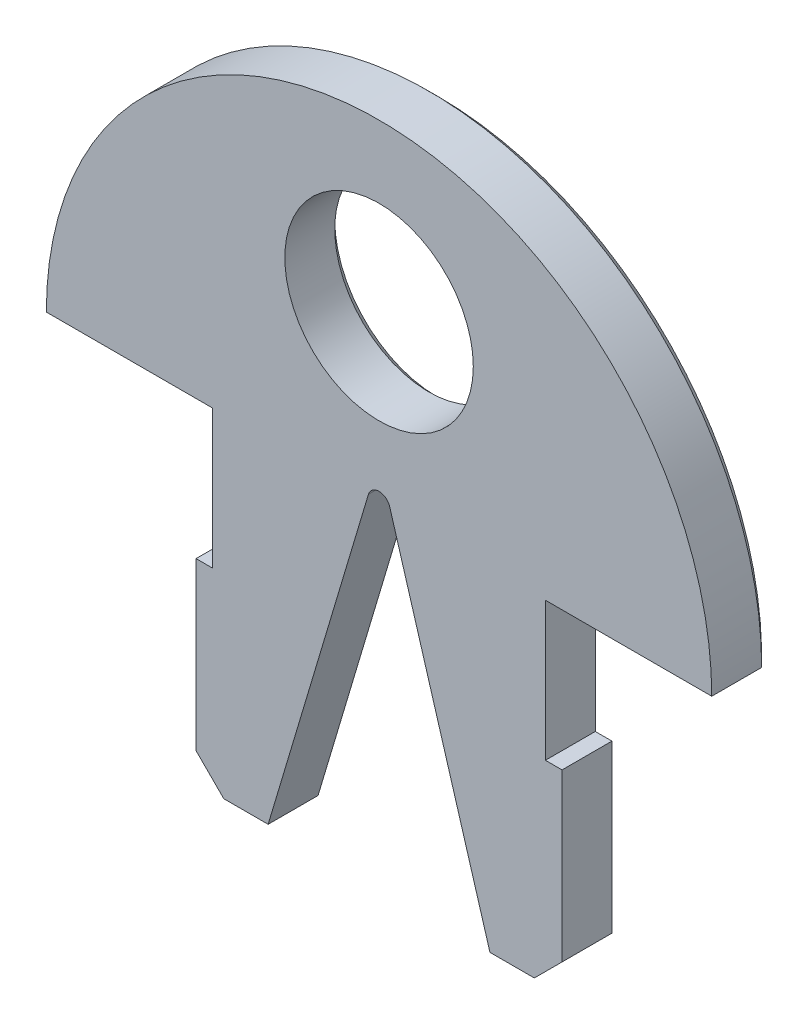
ISO-10303-21;
HEADER;
FILE_DESCRIPTION(('STEP AP214'),'2;1');
FILE_NAME('part.step','',(''),(''),'','','');
FILE_SCHEMA(('AUTOMOTIVE_DESIGN { 1 0 10303 214 1 1 1 1 }'));
ENDSEC;
DATA;
#1=APPLICATION_CONTEXT('core data for automotive mechanical design processes');
#2=APPLICATION_PROTOCOL_DEFINITION('international standard','automotive_design',2000,#1);
#3=PRODUCT_CONTEXT('',#1,'mechanical');
#4=PRODUCT('Part','Part','',(#3));
#5=PRODUCT_RELATED_PRODUCT_CATEGORY('part','',(#4));
#6=PRODUCT_DEFINITION_FORMATION('','',#4);
#7=PRODUCT_DEFINITION_CONTEXT('part definition',#1,'design');
#8=PRODUCT_DEFINITION('design','',#6,#7);
#9=PRODUCT_DEFINITION_SHAPE('','',#8);
#10=(LENGTH_UNIT() NAMED_UNIT(*) SI_UNIT(.MILLI.,.METRE.));
#11=(NAMED_UNIT(*) PLANE_ANGLE_UNIT() SI_UNIT($,.RADIAN.));
#12=(NAMED_UNIT(*) SI_UNIT($,.STERADIAN.) SOLID_ANGLE_UNIT());
#13=UNCERTAINTY_MEASURE_WITH_UNIT(LENGTH_MEASURE(1.E-05),#10,'distance_accuracy_value','');
#14=(GEOMETRIC_REPRESENTATION_CONTEXT(3) GLOBAL_UNCERTAINTY_ASSIGNED_CONTEXT((#13)) GLOBAL_UNIT_ASSIGNED_CONTEXT((#10,
#11,#12)) REPRESENTATION_CONTEXT('',''));
#15=CARTESIAN_POINT('',(0.,0.,0.));
#16=DIRECTION('',(0.,0.,1.));
#17=DIRECTION('',(1.,0.,0.));
#18=AXIS2_PLACEMENT_3D('',#15,#16,#17);
#19=CARTESIAN_POINT('',(0.,5.99999999999999,2.1));
#20=DIRECTION('',(0.,0.,1.));
#21=DIRECTION('',(1.,0.,0.));
#22=AXIS2_PLACEMENT_3D('',#19,#20,#21);
#23=PLANE('',#22);
#24=DIRECTION('',(1.,0.,0.));
#25=VECTOR('',#24,1.);
#26=CARTESIAN_POINT('',(4.,-6.00000000000001,2.1));
#27=LINE('',#26,#25);
#28=CARTESIAN_POINT('',(4.,-6.00000000000001,2.1));
#29=VERTEX_POINT('',#28);
#30=CARTESIAN_POINT('',(5.6,-6.00000000000001,2.1));
#31=VERTEX_POINT('',#30);
#32=EDGE_CURVE('E206',#29,#31,#27,.T.);
#33=ORIENTED_EDGE('',*,*,#32,.T.);
#34=DIRECTION('',(-0.707106781186549,-0.707106781186546,0.));
#35=VECTOR('',#34,1.);
#36=CARTESIAN_POINT('',(8.79999999999999,-2.80000000000003,2.1));
#37=LINE('',#36,#35);
#38=CARTESIAN_POINT('',(6.6,-5.00000000000001,2.1));
#39=VERTEX_POINT('',#38);
#40=EDGE_CURVE('E204',#31,#39,#37,.F.);
#41=ORIENTED_EDGE('',*,*,#40,.T.);
#42=DIRECTION('',(0.,1.,0.));
#43=VECTOR('',#42,1.);
#44=CARTESIAN_POINT('',(6.6,-6.00000000000001,2.1));
#45=LINE('',#44,#43);
#46=CARTESIAN_POINT('',(6.59999999999999,0.999999999999994,2.1));
#47=VERTEX_POINT('',#46);
#48=EDGE_CURVE('E196',#39,#47,#45,.T.);
#49=ORIENTED_EDGE('',*,*,#48,.T.);
#50=DIRECTION('',(-1.,0.,0.));
#51=VECTOR('',#50,1.);
#52=CARTESIAN_POINT('',(5.99999999999999,0.999999999999994,2.1));
#53=LINE('',#52,#51);
#54=CARTESIAN_POINT('',(5.99999999999999,0.999999999999994,2.1));
#55=VERTEX_POINT('',#54);
#56=EDGE_CURVE('E201',#47,#55,#53,.T.);
#57=ORIENTED_EDGE('',*,*,#56,.T.);
#58=DIRECTION('',(0.,1.,0.));
#59=VECTOR('',#58,1.);
#60=CARTESIAN_POINT('',(6.,5.99999999999999,2.1));
#61=LINE('',#60,#59);
#62=CARTESIAN_POINT('',(6.,5.99999999999999,2.1));
#63=VERTEX_POINT('',#62);
#64=EDGE_CURVE('E221',#55,#63,#61,.T.);
#65=ORIENTED_EDGE('',*,*,#64,.T.);
#66=DIRECTION('',(1.,0.,0.));
#67=VECTOR('',#66,1.);
#68=CARTESIAN_POINT('',(6.,5.99999999999999,2.1));
#69=LINE('',#68,#67);
#70=CARTESIAN_POINT('',(12.,5.99999999999999,2.1));
#71=VERTEX_POINT('',#70);
#72=EDGE_CURVE('E223',#63,#71,#69,.T.);
#73=ORIENTED_EDGE('',*,*,#72,.T.);
#74=CARTESIAN_POINT('',(0.,5.99999999999999,2.1));
#75=DIRECTION('',(0.,0.,1.));
#76=DIRECTION('',(1.,0.,0.));
#77=AXIS2_PLACEMENT_3D('',#74,#75,#76);
#78=CIRCLE('',#77,12.);
#79=CARTESIAN_POINT('',(-12.,5.99999999999999,2.1));
#80=VERTEX_POINT('',#79);
#81=EDGE_CURVE('E228',#71,#80,#78,.T.);
#82=ORIENTED_EDGE('',*,*,#81,.T.);
#83=DIRECTION('',(1.,0.,0.));
#84=VECTOR('',#83,1.);
#85=CARTESIAN_POINT('',(-12.,5.99999999999999,2.1));
#86=LINE('',#85,#84);
#87=CARTESIAN_POINT('',(-6.,5.99999999999999,2.1));
#88=VERTEX_POINT('',#87);
#89=EDGE_CURVE('E230',#80,#88,#86,.T.);
#90=ORIENTED_EDGE('',*,*,#89,.T.);
#91=DIRECTION('',(0.,-1.,0.));
#92=VECTOR('',#91,1.);
#93=CARTESIAN_POINT('',(-6.,5.99999999999999,2.1));
#94=LINE('',#93,#92);
#95=CARTESIAN_POINT('',(-5.99999999999999,0.999999999999994,2.1));
#96=VERTEX_POINT('',#95);
#97=EDGE_CURVE('E232',#88,#96,#94,.T.);
#98=ORIENTED_EDGE('',*,*,#97,.T.);
#99=DIRECTION('',(-1.,0.,0.));
#100=VECTOR('',#99,1.);
#101=CARTESIAN_POINT('',(-5.99999999999999,0.999999999999994,2.1));
#102=LINE('',#101,#100);
#103=CARTESIAN_POINT('',(-6.59999999999999,0.999999999999994,2.1));
#104=VERTEX_POINT('',#103);
#105=EDGE_CURVE('E234',#96,#104,#102,.T.);
#106=ORIENTED_EDGE('',*,*,#105,.T.);
#107=DIRECTION('',(0.,-1.,0.));
#108=VECTOR('',#107,1.);
#109=CARTESIAN_POINT('',(-6.6,-6.00000000000001,2.1));
#110=LINE('',#109,#108);
#111=CARTESIAN_POINT('',(-6.6,-5.,2.1));
#112=VERTEX_POINT('',#111);
#113=EDGE_CURVE('E236',#104,#112,#110,.T.);
#114=ORIENTED_EDGE('',*,*,#113,.T.);
#115=DIRECTION('',(-0.707106781186545,0.70710678118655,0.));
#116=VECTOR('',#115,1.);
#117=CARTESIAN_POINT('',(-8.80000000000002,-2.79999999999997,2.1));
#118=LINE('',#117,#116);
#119=CARTESIAN_POINT('',(-5.6,-6.00000000000001,2.1));
#120=VERTEX_POINT('',#119);
#121=EDGE_CURVE('E280',#112,#120,#118,.F.);
#122=ORIENTED_EDGE('',*,*,#121,.T.);
#123=DIRECTION('',(1.,0.,0.));
#124=VECTOR('',#123,1.);
#125=CARTESIAN_POINT('',(-6.,-6.00000000000001,2.1));
#126=LINE('',#125,#124);
#127=CARTESIAN_POINT('',(-4.,-6.00000000000001,2.1));
#128=VERTEX_POINT('',#127);
#129=EDGE_CURVE('E239',#120,#128,#126,.T.);
#130=ORIENTED_EDGE('',*,*,#129,.T.);
#131=DIRECTION('',(0.286069612585582,0.958208837756747,0.));
#132=VECTOR('',#131,1.);
#133=CARTESIAN_POINT('',(-4.,-6.00000000000001,2.1));
#134=LINE('',#133,#132);
#135=CARTESIAN_POINT('',(-0.383283535102698,6.11442784503422,2.1));
#136=VERTEX_POINT('',#135);
#137=EDGE_CURVE('E241',#128,#136,#134,.T.);
#138=ORIENTED_EDGE('',*,*,#137,.T.);
#139=CARTESIAN_POINT('',(0.,5.99999999999999,2.1));
#140=DIRECTION('',(0.,0.,-1.));
#141=DIRECTION('',(1.,0.,0.));
#142=AXIS2_PLACEMENT_3D('',#139,#140,#141);
#143=CIRCLE('',#142,0.4);
#144=CARTESIAN_POINT('',(0.383283535102698,6.11442784503422,2.1));
#145=VERTEX_POINT('',#144);
#146=EDGE_CURVE('E243',#136,#145,#143,.T.);
#147=ORIENTED_EDGE('',*,*,#146,.T.);
#148=DIRECTION('',(0.286069612585582,-0.958208837756747,0.));
#149=VECTOR('',#148,1.);
#150=CARTESIAN_POINT('',(0.383283535102699,6.11442784503422,2.1));
#151=LINE('',#150,#149);
#152=EDGE_CURVE('E245',#145,#29,#151,.T.);
#153=ORIENTED_EDGE('',*,*,#152,.T.);
#154=EDGE_LOOP('',(#33,#41,#49,#57,#65,#73,#82,#90,#98,#106,#114,#122,#130,#138,#147,#153));
#155=FACE_BOUND('',#154,.T.);
#156=CARTESIAN_POINT('',(0.,12.,2.1));
#157=DIRECTION('',(0.,0.,1.));
#158=DIRECTION('',(1.,0.,0.));
#159=AXIS2_PLACEMENT_3D('',#156,#157,#158);
#160=CIRCLE('',#159,3.39925487353985);
#161=CARTESIAN_POINT('',(3.39925487353984,12.,2.1));
#162=VERTEX_POINT('',#161);
#163=EDGE_CURVE('E429',#162,#162,#160,.T.);
#164=ORIENTED_EDGE('',*,*,#163,.F.);
#165=EDGE_LOOP('',(#164));
#166=FACE_BOUND('',#165,.T.);
#167=ADVANCED_FACE('F34',(#155,#166),#23,.T.);
#168=CARTESIAN_POINT('',(0.,5.99999999999999,0.));
#169=DIRECTION('',(0.,0.,1.));
#170=DIRECTION('',(1.,0.,0.));
#171=AXIS2_PLACEMENT_3D('',#168,#169,#170);
#172=PLANE('',#171);
#173=CARTESIAN_POINT('',(0.,12.,0.));
#174=DIRECTION('',(0.,0.,1.));
#175=DIRECTION('',(1.,0.,0.));
#176=AXIS2_PLACEMENT_3D('',#173,#174,#175);
#177=CIRCLE('',#176,3.69925487353985);
#178=CARTESIAN_POINT('',(3.69925487353984,12.,0.));
#179=VERTEX_POINT('',#178);
#180=EDGE_CURVE('E321',#179,#179,#177,.T.);
#181=ORIENTED_EDGE('',*,*,#180,.T.);
#182=EDGE_LOOP('',(#181));
#183=FACE_BOUND('',#182,.T.);
#184=DIRECTION('',(0.,-1.,0.));
#185=VECTOR('',#184,1.);
#186=CARTESIAN_POINT('',(5.7,5.99999999999998,0.));
#187=LINE('',#186,#185);
#188=CARTESIAN_POINT('',(5.7,6.3,0.));
#189=VERTEX_POINT('',#188);
#190=CARTESIAN_POINT('',(5.69999999999999,0.699999999999993,0.));
#191=VERTEX_POINT('',#190);
#192=EDGE_CURVE('E316',#189,#191,#187,.T.);
#193=ORIENTED_EDGE('',*,*,#192,.T.);
#194=DIRECTION('',(1.,0.,0.));
#195=VECTOR('',#194,1.);
#196=CARTESIAN_POINT('',(0.,0.699999999999997,0.));
#197=LINE('',#196,#195);
#198=CARTESIAN_POINT('',(6.29999999999999,0.699999999999992,0.));
#199=VERTEX_POINT('',#198);
#200=EDGE_CURVE('E318',#191,#199,#197,.T.);
#201=ORIENTED_EDGE('',*,*,#200,.T.);
#202=DIRECTION('',(0.,-1.,0.));
#203=VECTOR('',#202,1.);
#204=CARTESIAN_POINT('',(6.29999999999998,6.,0.));
#205=LINE('',#204,#203);
#206=CARTESIAN_POINT('',(6.3,-4.87573593128808,0.));
#207=VERTEX_POINT('',#206);
#208=EDGE_CURVE('E288',#199,#207,#205,.T.);
#209=ORIENTED_EDGE('',*,*,#208,.T.);
#210=DIRECTION('',(-0.707106781186549,-0.707106781186546,0.));
#211=VECTOR('',#210,1.);
#212=CARTESIAN_POINT('',(5.38786796564403,-5.78786796564404,0.));
#213=LINE('',#212,#211);
#214=CARTESIAN_POINT('',(5.47573593128807,-5.7,0.));
#215=VERTEX_POINT('',#214);
#216=EDGE_CURVE('E290',#207,#215,#213,.T.);
#217=ORIENTED_EDGE('',*,*,#216,.T.);
#218=DIRECTION('',(-1.,0.,0.));
#219=VECTOR('',#218,1.);
#220=CARTESIAN_POINT('',(0.,-5.7,0.));
#221=LINE('',#220,#219);
#222=CARTESIAN_POINT('',(4.22352028888164,-5.7,0.));
#223=VERTEX_POINT('',#222);
#224=EDGE_CURVE('E292',#215,#223,#221,.T.);
#225=ORIENTED_EDGE('',*,*,#224,.T.);
#226=DIRECTION('',(-0.286069612585582,0.958208837756746,0.));
#227=VECTOR('',#226,1.);
#228=CARTESIAN_POINT('',(0.670746186429724,6.2002487288099,0.));
#229=LINE('',#228,#227);
#230=CARTESIAN_POINT('',(0.670746186429724,6.2002487288099,0.));
#231=VERTEX_POINT('',#230);
#232=EDGE_CURVE('E294',#223,#231,#229,.T.);
#233=ORIENTED_EDGE('',*,*,#232,.T.);
#234=CARTESIAN_POINT('',(0.,5.99999999999999,0.));
#235=DIRECTION('',(0.,0.,1.));
#236=DIRECTION('',(1.,0.,0.));
#237=AXIS2_PLACEMENT_3D('',#234,#235,#236);
#238=CIRCLE('',#237,0.700000000000001);
#239=CARTESIAN_POINT('',(-0.670746186429724,6.2002487288099,0.));
#240=VERTEX_POINT('',#239);
#241=EDGE_CURVE('E296',#231,#240,#238,.T.);
#242=ORIENTED_EDGE('',*,*,#241,.T.);
#243=DIRECTION('',(-0.286069612585582,-0.958208837756747,0.));
#244=VECTOR('',#243,1.);
#245=CARTESIAN_POINT('',(-0.670746186429724,6.2002487288099,0.));
#246=LINE('',#245,#244);
#247=CARTESIAN_POINT('',(-4.22352028888164,-5.70000000000001,0.));
#248=VERTEX_POINT('',#247);
#249=EDGE_CURVE('E298',#240,#248,#246,.T.);
#250=ORIENTED_EDGE('',*,*,#249,.T.);
#251=DIRECTION('',(-1.,0.,0.));
#252=VECTOR('',#251,1.);
#253=CARTESIAN_POINT('',(0.,-5.70000000000002,0.));
#254=LINE('',#253,#252);
#255=CARTESIAN_POINT('',(-5.47573593128807,-5.70000000000001,0.));
#256=VERTEX_POINT('',#255);
#257=EDGE_CURVE('E300',#248,#256,#254,.T.);
#258=ORIENTED_EDGE('',*,*,#257,.T.);
#259=DIRECTION('',(-0.707106781186545,0.70710678118655,0.));
#260=VECTOR('',#259,1.);
#261=CARTESIAN_POINT('',(-6.38786796564403,-4.78786796564404,0.));
#262=LINE('',#261,#260);
#263=CARTESIAN_POINT('',(-6.29999999999999,-4.87573593128807,0.));
#264=VERTEX_POINT('',#263);
#265=EDGE_CURVE('E302',#256,#264,#262,.T.);
#266=ORIENTED_EDGE('',*,*,#265,.T.);
#267=DIRECTION('',(0.,1.,0.));
#268=VECTOR('',#267,1.);
#269=CARTESIAN_POINT('',(-6.29999999999998,6.,0.));
#270=LINE('',#269,#268);
#271=CARTESIAN_POINT('',(-6.29999999999999,0.699999999999992,0.));
#272=VERTEX_POINT('',#271);
#273=EDGE_CURVE('E304',#264,#272,#270,.T.);
#274=ORIENTED_EDGE('',*,*,#273,.T.);
#275=DIRECTION('',(1.,0.,0.));
#276=VECTOR('',#275,1.);
#277=CARTESIAN_POINT('',(0.,0.699999999999997,0.));
#278=LINE('',#277,#276);
#279=CARTESIAN_POINT('',(-5.69999999999999,0.699999999999993,0.));
#280=VERTEX_POINT('',#279);
#281=EDGE_CURVE('E306',#272,#280,#278,.T.);
#282=ORIENTED_EDGE('',*,*,#281,.T.);
#283=DIRECTION('',(0.,1.,0.));
#284=VECTOR('',#283,1.);
#285=CARTESIAN_POINT('',(-5.7,5.99999999999998,0.));
#286=LINE('',#285,#284);
#287=CARTESIAN_POINT('',(-5.7,6.3,0.));
#288=VERTEX_POINT('',#287);
#289=EDGE_CURVE('E308',#280,#288,#286,.T.);
#290=ORIENTED_EDGE('',*,*,#289,.T.);
#291=DIRECTION('',(-1.,0.,0.));
#292=VECTOR('',#291,1.);
#293=CARTESIAN_POINT('',(0.,6.3,0.));
#294=LINE('',#293,#292);
#295=CARTESIAN_POINT('',(-11.6961532137708,6.29999999999999,0.));
#296=VERTEX_POINT('',#295);
#297=EDGE_CURVE('E310',#288,#296,#294,.T.);
#298=ORIENTED_EDGE('',*,*,#297,.T.);
#299=CARTESIAN_POINT('',(0.,5.99999999999999,0.));
#300=DIRECTION('',(0.,0.,1.));
#301=DIRECTION('',(1.,0.,0.));
#302=AXIS2_PLACEMENT_3D('',#299,#300,#301);
#303=CIRCLE('',#302,11.7);
#304=CARTESIAN_POINT('',(11.6961532137708,6.29999999999999,0.));
#305=VERTEX_POINT('',#304);
#306=EDGE_CURVE('E312',#296,#305,#303,.F.);
#307=ORIENTED_EDGE('',*,*,#306,.T.);
#308=DIRECTION('',(-1.,0.,0.));
#309=VECTOR('',#308,1.);
#310=CARTESIAN_POINT('',(0.,6.3,0.));
#311=LINE('',#310,#309);
#312=EDGE_CURVE('E314',#305,#189,#311,.T.);
#313=ORIENTED_EDGE('',*,*,#312,.T.);
#314=EDGE_LOOP('',(#193,#201,#209,#217,#225,#233,#242,#250,#258,#266,#274,#282,#290,#298,#307,#313));
#315=FACE_BOUND('',#314,.T.);
#316=ADVANCED_FACE('F524',(#183,#315),#172,.F.);
#317=CARTESIAN_POINT('',(6.,-6.00000000000001,2.1));
#318=DIRECTION('',(0.,1.,0.));
#319=DIRECTION('',(0.,0.,1.));
#320=AXIS2_PLACEMENT_3D('',#317,#318,#319);
#321=PLANE('',#320);
#322=DIRECTION('',(0.,0.,-1.));
#323=VECTOR('',#322,1.);
#324=CARTESIAN_POINT('',(4.,-6.00000000000001,2.1));
#325=LINE('',#324,#323);
#326=CARTESIAN_POINT('',(4.,-6.00000000000001,0.300000000000002));
#327=VERTEX_POINT('',#326);
#328=EDGE_CURVE('E247',#29,#327,#325,.T.);
#329=ORIENTED_EDGE('',*,*,#328,.T.);
#330=DIRECTION('',(1.,0.,0.));
#331=VECTOR('',#330,1.);
#332=CARTESIAN_POINT('',(6.,-6.00000000000001,0.300000000000002));
#333=LINE('',#332,#331);
#334=CARTESIAN_POINT('',(5.6,-6.00000000000001,0.300000000000002));
#335=VERTEX_POINT('',#334);
#336=EDGE_CURVE('E58',#327,#335,#333,.T.);
#337=ORIENTED_EDGE('',*,*,#336,.T.);
#338=DIRECTION('',(0.,0.,1.));
#339=VECTOR('',#338,1.);
#340=CARTESIAN_POINT('',(5.6,-6.00000000000001,2.1));
#341=LINE('',#340,#339);
#342=EDGE_CURVE('E278',#335,#31,#341,.T.);
#343=ORIENTED_EDGE('',*,*,#342,.T.);
#344=ORIENTED_EDGE('',*,*,#32,.F.);
#345=EDGE_LOOP('',(#329,#337,#343,#344));
#346=FACE_BOUND('',#345,.T.);
#347=ADVANCED_FACE('F518',(#346),#321,.F.);
#348=CARTESIAN_POINT('',(6.6,-6.00000000000001,2.1));
#349=DIRECTION('',(-1.,0.,0.));
#350=DIRECTION('',(0.,-1.,0.));
#351=AXIS2_PLACEMENT_3D('',#348,#349,#350);
#352=PLANE('',#351);
#353=DIRECTION('',(0.,0.,-1.));
#354=VECTOR('',#353,1.);
#355=CARTESIAN_POINT('',(6.6,-5.,2.1));
#356=LINE('',#355,#354);
#357=CARTESIAN_POINT('',(6.6,-5.,0.300000000000002));
#358=VERTEX_POINT('',#357);
#359=EDGE_CURVE('E215',#39,#358,#356,.T.);
#360=ORIENTED_EDGE('',*,*,#359,.T.);
#361=DIRECTION('',(0.,1.,0.));
#362=VECTOR('',#361,1.);
#363=CARTESIAN_POINT('',(6.6,-6.00000000000001,0.300000000000002));
#364=LINE('',#363,#362);
#365=CARTESIAN_POINT('',(6.59999999999999,0.999999999999994,0.300000000000002));
#366=VERTEX_POINT('',#365);
#367=EDGE_CURVE('E11',#358,#366,#364,.T.);
#368=ORIENTED_EDGE('',*,*,#367,.T.);
#369=DIRECTION('',(0.,0.,-1.));
#370=VECTOR('',#369,1.);
#371=CARTESIAN_POINT('',(6.59999999999999,0.999999999999994,2.1));
#372=LINE('',#371,#370);
#373=EDGE_CURVE('E209',#47,#366,#372,.T.);
#374=ORIENTED_EDGE('',*,*,#373,.F.);
#375=ORIENTED_EDGE('',*,*,#48,.F.);
#376=EDGE_LOOP('',(#360,#368,#374,#375));
#377=FACE_BOUND('',#376,.T.);
#378=ADVANCED_FACE('F210',(#377),#352,.F.);
#379=CARTESIAN_POINT('',(5.99999999999999,0.999999999999994,2.1));
#380=DIRECTION('',(0.,-1.,0.));
#381=DIRECTION('',(1.,0.,0.));
#382=AXIS2_PLACEMENT_3D('',#379,#380,#381);
#383=PLANE('',#382);
#384=ORIENTED_EDGE('',*,*,#373,.T.);
#385=DIRECTION('',(-1.,0.,0.));
#386=VECTOR('',#385,1.);
#387=CARTESIAN_POINT('',(5.99999999999999,0.999999999999994,0.300000000000002));
#388=LINE('',#387,#386);
#389=CARTESIAN_POINT('',(5.99999999999999,0.999999999999994,0.300000000000002));
#390=VERTEX_POINT('',#389);
#391=EDGE_CURVE('E327',#366,#390,#388,.T.);
#392=ORIENTED_EDGE('',*,*,#391,.T.);
#393=DIRECTION('',(0.,0.,-1.));
#394=VECTOR('',#393,1.);
#395=CARTESIAN_POINT('',(5.99999999999999,0.999999999999994,2.1));
#396=LINE('',#395,#394);
#397=EDGE_CURVE('E216',#55,#390,#396,.T.);
#398=ORIENTED_EDGE('',*,*,#397,.F.);
#399=ORIENTED_EDGE('',*,*,#56,.F.);
#400=EDGE_LOOP('',(#384,#392,#398,#399));
#401=FACE_BOUND('',#400,.T.);
#402=ADVANCED_FACE('F218',(#401),#383,.F.);
#403=CARTESIAN_POINT('',(6.,5.99999999999999,2.1));
#404=DIRECTION('',(-1.,0.,0.));
#405=DIRECTION('',(0.,-1.,0.));
#406=AXIS2_PLACEMENT_3D('',#403,#404,#405);
#407=PLANE('',#406);
#408=ORIENTED_EDGE('',*,*,#397,.T.);
#409=DIRECTION('',(0.,1.,0.));
#410=VECTOR('',#409,1.);
#411=CARTESIAN_POINT('',(6.,5.99999999999999,0.300000000000002));
#412=LINE('',#411,#410);
#413=CARTESIAN_POINT('',(6.,5.99999999999999,0.300000000000002));
#414=VERTEX_POINT('',#413);
#415=EDGE_CURVE('E329',#390,#414,#412,.T.);
#416=ORIENTED_EDGE('',*,*,#415,.T.);
#417=DIRECTION('',(0.,0.,-1.));
#418=VECTOR('',#417,1.);
#419=CARTESIAN_POINT('',(6.,5.99999999999999,2.1));
#420=LINE('',#419,#418);
#421=EDGE_CURVE('E273',#63,#414,#420,.T.);
#422=ORIENTED_EDGE('',*,*,#421,.F.);
#423=ORIENTED_EDGE('',*,*,#64,.F.);
#424=EDGE_LOOP('',(#408,#416,#422,#423));
#425=FACE_BOUND('',#424,.T.);
#426=ADVANCED_FACE('F455',(#425),#407,.F.);
#427=CARTESIAN_POINT('',(6.,5.99999999999999,2.1));
#428=DIRECTION('',(0.,1.,0.));
#429=DIRECTION('',(-1.,0.,0.));
#430=AXIS2_PLACEMENT_3D('',#427,#428,#429);
#431=PLANE('',#430);
#432=ORIENTED_EDGE('',*,*,#421,.T.);
#433=DIRECTION('',(1.,0.,0.));
#434=VECTOR('',#433,1.);
#435=CARTESIAN_POINT('',(6.,5.99999999999999,0.300000000000002));
#436=LINE('',#435,#434);
#437=CARTESIAN_POINT('',(12.,5.99999999999999,0.300000000000002));
#438=VERTEX_POINT('',#437);
#439=EDGE_CURVE('E331',#414,#438,#436,.T.);
#440=ORIENTED_EDGE('',*,*,#439,.T.);
#441=DIRECTION('',(0.,0.,-1.));
#442=VECTOR('',#441,1.);
#443=CARTESIAN_POINT('',(12.,5.99999999999999,2.1));
#444=LINE('',#443,#442);
#445=EDGE_CURVE('E270',#71,#438,#444,.T.);
#446=ORIENTED_EDGE('',*,*,#445,.F.);
#447=ORIENTED_EDGE('',*,*,#72,.F.);
#448=EDGE_LOOP('',(#432,#440,#446,#447));
#449=FACE_BOUND('',#448,.T.);
#450=ADVANCED_FACE('F462',(#449),#431,.F.);
#451=CARTESIAN_POINT('',(0.,5.99999999999999,2.1));
#452=DIRECTION('',(0.,0.,-1.));
#453=DIRECTION('',(-1.,0.,0.));
#454=AXIS2_PLACEMENT_3D('',#451,#452,#453);
#455=CYLINDRICAL_SURFACE('',#454,12.);
#456=ORIENTED_EDGE('',*,*,#445,.T.);
#457=CARTESIAN_POINT('',(0.,5.99999999999999,0.300000000000002));
#458=DIRECTION('',(0.,0.,1.));
#459=DIRECTION('',(1.,0.,0.));
#460=AXIS2_PLACEMENT_3D('',#457,#458,#459);
#461=CIRCLE('',#460,12.);
#462=CARTESIAN_POINT('',(-12.,5.99999999999999,0.300000000000002));
#463=VERTEX_POINT('',#462);
#464=EDGE_CURVE('E333',#438,#463,#461,.T.);
#465=ORIENTED_EDGE('',*,*,#464,.T.);
#466=DIRECTION('',(0.,0.,-1.));
#467=VECTOR('',#466,1.);
#468=CARTESIAN_POINT('',(-12.,5.99999999999999,2.1));
#469=LINE('',#468,#467);
#470=EDGE_CURVE('E267',#80,#463,#469,.T.);
#471=ORIENTED_EDGE('',*,*,#470,.F.);
#472=ORIENTED_EDGE('',*,*,#81,.F.);
#473=EDGE_LOOP('',(#456,#465,#471,#472));
#474=FACE_BOUND('',#473,.T.);
#475=ADVANCED_FACE('F466',(#474),#455,.T.);
#476=CARTESIAN_POINT('',(-12.,5.99999999999999,2.1));
#477=DIRECTION('',(0.,1.,0.));
#478=DIRECTION('',(-1.,0.,0.));
#479=AXIS2_PLACEMENT_3D('',#476,#477,#478);
#480=PLANE('',#479);
#481=ORIENTED_EDGE('',*,*,#470,.T.);
#482=DIRECTION('',(1.,0.,0.));
#483=VECTOR('',#482,1.);
#484=CARTESIAN_POINT('',(-12.,5.99999999999999,0.300000000000002));
#485=LINE('',#484,#483);
#486=CARTESIAN_POINT('',(-6.,5.99999999999999,0.300000000000002));
#487=VERTEX_POINT('',#486);
#488=EDGE_CURVE('E335',#463,#487,#485,.T.);
#489=ORIENTED_EDGE('',*,*,#488,.T.);
#490=DIRECTION('',(0.,0.,-1.));
#491=VECTOR('',#490,1.);
#492=CARTESIAN_POINT('',(-6.,5.99999999999999,2.1));
#493=LINE('',#492,#491);
#494=EDGE_CURVE('E264',#88,#487,#493,.T.);
#495=ORIENTED_EDGE('',*,*,#494,.F.);
#496=ORIENTED_EDGE('',*,*,#89,.F.);
#497=EDGE_LOOP('',(#481,#489,#495,#496));
#498=FACE_BOUND('',#497,.T.);
#499=ADVANCED_FACE('F471',(#498),#480,.F.);
#500=CARTESIAN_POINT('',(-6.,5.99999999999999,2.1));
#501=DIRECTION('',(1.,0.,0.));
#502=DIRECTION('',(0.,1.,0.));
#503=AXIS2_PLACEMENT_3D('',#500,#501,#502);
#504=PLANE('',#503);
#505=ORIENTED_EDGE('',*,*,#494,.T.);
#506=DIRECTION('',(0.,-1.,0.));
#507=VECTOR('',#506,1.);
#508=CARTESIAN_POINT('',(-6.,5.99999999999999,0.300000000000002));
#509=LINE('',#508,#507);
#510=CARTESIAN_POINT('',(-5.99999999999999,0.999999999999994,0.300000000000002));
#511=VERTEX_POINT('',#510);
#512=EDGE_CURVE('E337',#487,#511,#509,.T.);
#513=ORIENTED_EDGE('',*,*,#512,.T.);
#514=DIRECTION('',(0.,0.,-1.));
#515=VECTOR('',#514,1.);
#516=CARTESIAN_POINT('',(-5.99999999999999,0.999999999999994,2.1));
#517=LINE('',#516,#515);
#518=EDGE_CURVE('E261',#96,#511,#517,.T.);
#519=ORIENTED_EDGE('',*,*,#518,.F.);
#520=ORIENTED_EDGE('',*,*,#97,.F.);
#521=EDGE_LOOP('',(#505,#513,#519,#520));
#522=FACE_BOUND('',#521,.T.);
#523=ADVANCED_FACE('F477',(#522),#504,.F.);
#524=CARTESIAN_POINT('',(-5.99999999999999,0.999999999999994,2.1));
#525=DIRECTION('',(0.,-1.,0.));
#526=DIRECTION('',(1.,0.,0.));
#527=AXIS2_PLACEMENT_3D('',#524,#525,#526);
#528=PLANE('',#527);
#529=ORIENTED_EDGE('',*,*,#518,.T.);
#530=DIRECTION('',(-1.,0.,0.));
#531=VECTOR('',#530,1.);
#532=CARTESIAN_POINT('',(-5.99999999999999,0.999999999999994,0.300000000000002));
#533=LINE('',#532,#531);
#534=CARTESIAN_POINT('',(-6.59999999999999,0.999999999999994,0.300000000000002));
#535=VERTEX_POINT('',#534);
#536=EDGE_CURVE('E339',#511,#535,#533,.T.);
#537=ORIENTED_EDGE('',*,*,#536,.T.);
#538=DIRECTION('',(0.,0.,-1.));
#539=VECTOR('',#538,1.);
#540=CARTESIAN_POINT('',(-6.59999999999999,0.999999999999994,2.1));
#541=LINE('',#540,#539);
#542=EDGE_CURVE('E258',#104,#535,#541,.T.);
#543=ORIENTED_EDGE('',*,*,#542,.F.);
#544=ORIENTED_EDGE('',*,*,#105,.F.);
#545=EDGE_LOOP('',(#529,#537,#543,#544));
#546=FACE_BOUND('',#545,.T.);
#547=ADVANCED_FACE('F481',(#546),#528,.F.);
#548=CARTESIAN_POINT('',(-6.6,-6.00000000000001,2.1));
#549=DIRECTION('',(1.,0.,0.));
#550=DIRECTION('',(0.,1.,0.));
#551=AXIS2_PLACEMENT_3D('',#548,#549,#550);
#552=PLANE('',#551);
#553=ORIENTED_EDGE('',*,*,#542,.T.);
#554=DIRECTION('',(0.,-1.,0.));
#555=VECTOR('',#554,1.);
#556=CARTESIAN_POINT('',(-6.6,-6.00000000000001,0.300000000000002));
#557=LINE('',#556,#555);
#558=CARTESIAN_POINT('',(-6.6,-5.,0.300000000000002));
#559=VERTEX_POINT('',#558);
#560=EDGE_CURVE('E341',#535,#559,#557,.T.);
#561=ORIENTED_EDGE('',*,*,#560,.T.);
#562=DIRECTION('',(0.,0.,1.));
#563=VECTOR('',#562,1.);
#564=CARTESIAN_POINT('',(-6.6,-5.,2.1));
#565=LINE('',#564,#563);
#566=EDGE_CURVE('E286',#559,#112,#565,.T.);
#567=ORIENTED_EDGE('',*,*,#566,.T.);
#568=ORIENTED_EDGE('',*,*,#113,.F.);
#569=EDGE_LOOP('',(#553,#561,#567,#568));
#570=FACE_BOUND('',#569,.T.);
#571=ADVANCED_FACE('F484',(#570),#552,.F.);
#572=CARTESIAN_POINT('',(-6.,-6.00000000000001,2.1));
#573=DIRECTION('',(0.,1.,0.));
#574=DIRECTION('',(-1.,0.,0.));
#575=AXIS2_PLACEMENT_3D('',#572,#573,#574);
#576=PLANE('',#575);
#577=DIRECTION('',(0.,0.,-1.));
#578=VECTOR('',#577,1.);
#579=CARTESIAN_POINT('',(-5.6,-6.00000000000001,2.1));
#580=LINE('',#579,#578);
#581=CARTESIAN_POINT('',(-5.6,-6.00000000000001,0.300000000000002));
#582=VERTEX_POINT('',#581);
#583=EDGE_CURVE('E283',#120,#582,#580,.T.);
#584=ORIENTED_EDGE('',*,*,#583,.T.);
#585=DIRECTION('',(1.,0.,0.));
#586=VECTOR('',#585,1.);
#587=CARTESIAN_POINT('',(-6.,-6.00000000000001,0.300000000000002));
#588=LINE('',#587,#586);
#589=CARTESIAN_POINT('',(-4.,-6.00000000000001,0.300000000000002));
#590=VERTEX_POINT('',#589);
#591=EDGE_CURVE('E345',#582,#590,#588,.T.);
#592=ORIENTED_EDGE('',*,*,#591,.T.);
#593=DIRECTION('',(0.,0.,-1.));
#594=VECTOR('',#593,1.);
#595=CARTESIAN_POINT('',(-4.,-6.00000000000001,2.1));
#596=LINE('',#595,#594);
#597=EDGE_CURVE('E255',#128,#590,#596,.T.);
#598=ORIENTED_EDGE('',*,*,#597,.F.);
#599=ORIENTED_EDGE('',*,*,#129,.F.);
#600=EDGE_LOOP('',(#584,#592,#598,#599));
#601=FACE_BOUND('',#600,.T.);
#602=ADVANCED_FACE('F493',(#601),#576,.F.);
#603=CARTESIAN_POINT('',(-4.,-6.00000000000001,2.1));
#604=DIRECTION('',(-0.958208837756746,0.286069612585582,0.));
#605=DIRECTION('',(-0.286069612585582,-0.958208837756747,0.));
#606=AXIS2_PLACEMENT_3D('',#603,#604,#605);
#607=PLANE('',#606);
#608=ORIENTED_EDGE('',*,*,#597,.T.);
#609=DIRECTION('',(0.286069612585582,0.958208837756747,0.));
#610=VECTOR('',#609,1.);
#611=CARTESIAN_POINT('',(-4.,-6.00000000000001,0.300000000000002));
#612=LINE('',#611,#610);
#613=CARTESIAN_POINT('',(-0.383283535102698,6.11442784503422,0.300000000000002));
#614=VERTEX_POINT('',#613);
#615=EDGE_CURVE('E347',#590,#614,#612,.T.);
#616=ORIENTED_EDGE('',*,*,#615,.T.);
#617=DIRECTION('',(0.,0.,-1.));
#618=VECTOR('',#617,1.);
#619=CARTESIAN_POINT('',(-0.383283535102698,6.11442784503422,2.1));
#620=LINE('',#619,#618);
#621=EDGE_CURVE('E252',#136,#614,#620,.T.);
#622=ORIENTED_EDGE('',*,*,#621,.F.);
#623=ORIENTED_EDGE('',*,*,#137,.F.);
#624=EDGE_LOOP('',(#608,#616,#622,#623));
#625=FACE_BOUND('',#624,.T.);
#626=ADVANCED_FACE('F507',(#625),#607,.F.);
#627=CARTESIAN_POINT('',(0.,5.99999999999999,2.1));
#628=DIRECTION('',(0.,0.,-1.));
#629=DIRECTION('',(-1.,0.,0.));
#630=AXIS2_PLACEMENT_3D('',#627,#628,#629);
#631=CYLINDRICAL_SURFACE('',#630,0.4);
#632=ORIENTED_EDGE('',*,*,#621,.T.);
#633=CARTESIAN_POINT('',(0.,5.99999999999999,0.300000000000002));
#634=DIRECTION('',(0.,0.,1.));
#635=DIRECTION('',(1.,0.,0.));
#636=AXIS2_PLACEMENT_3D('',#633,#634,#635);
#637=CIRCLE('',#636,0.4);
#638=CARTESIAN_POINT('',(0.383283535102698,6.11442784503422,0.300000000000002));
#639=VERTEX_POINT('',#638);
#640=EDGE_CURVE('E349',#614,#639,#637,.F.);
#641=ORIENTED_EDGE('',*,*,#640,.T.);
#642=DIRECTION('',(0.,0.,-1.));
#643=VECTOR('',#642,1.);
#644=CARTESIAN_POINT('',(0.383283535102698,6.11442784503422,2.1));
#645=LINE('',#644,#643);
#646=EDGE_CURVE('E249',#145,#639,#645,.T.);
#647=ORIENTED_EDGE('',*,*,#646,.F.);
#648=ORIENTED_EDGE('',*,*,#146,.F.);
#649=EDGE_LOOP('',(#632,#641,#647,#648));
#650=FACE_BOUND('',#649,.T.);
#651=ADVANCED_FACE('F511',(#650),#631,.F.);
#652=CARTESIAN_POINT('',(0.383283535102699,6.11442784503422,2.1));
#653=DIRECTION('',(0.958208837756746,0.286069612585582,0.));
#654=DIRECTION('',(-0.286069612585582,0.958208837756746,0.));
#655=AXIS2_PLACEMENT_3D('',#652,#653,#654);
#656=PLANE('',#655);
#657=ORIENTED_EDGE('',*,*,#646,.T.);
#658=DIRECTION('',(0.286069612585582,-0.958208837756746,0.));
#659=VECTOR('',#658,1.);
#660=CARTESIAN_POINT('',(0.383283535102699,6.11442784503422,0.300000000000002));
#661=LINE('',#660,#659);
#662=EDGE_CURVE('E351',#639,#327,#661,.T.);
#663=ORIENTED_EDGE('',*,*,#662,.T.);
#664=ORIENTED_EDGE('',*,*,#328,.F.);
#665=ORIENTED_EDGE('',*,*,#152,.F.);
#666=EDGE_LOOP('',(#657,#663,#664,#665));
#667=FACE_BOUND('',#666,.T.);
#668=ADVANCED_FACE('F515',(#667),#656,.F.);
#669=CARTESIAN_POINT('',(0.,12.,2.1));
#670=DIRECTION('',(0.,0.,-1.));
#671=DIRECTION('',(-1.,0.,0.));
#672=AXIS2_PLACEMENT_3D('',#669,#670,#671);
#673=CYLINDRICAL_SURFACE('',#672,3.39925487353985);
#674=CARTESIAN_POINT('',(0.,12.,0.299999999999999));
#675=DIRECTION('',(0.,0.,1.));
#676=DIRECTION('',(1.,0.,0.));
#677=AXIS2_PLACEMENT_3D('',#674,#675,#676);
#678=CIRCLE('',#677,3.39925487353985);
#679=CARTESIAN_POINT('',(3.39925487353984,12.,0.299999999999999));
#680=VERTEX_POINT('',#679);
#681=EDGE_CURVE('E324',#680,#680,#678,.F.);
#682=ORIENTED_EDGE('',*,*,#681,.T.);
#683=EDGE_LOOP('',(#682));
#684=FACE_BOUND('',#683,.T.);
#685=ORIENTED_EDGE('',*,*,#163,.T.);
#686=EDGE_LOOP('',(#685));
#687=FACE_BOUND('',#686,.T.);
#688=ADVANCED_FACE('F564',(#684,#687),#673,.F.);
#689=CARTESIAN_POINT('',(6.6,-5.,2.1));
#690=DIRECTION('',(-0.707106781186546,0.707106781186549,0.));
#691=DIRECTION('',(0.,0.,-1.));
#692=AXIS2_PLACEMENT_3D('',#689,#690,#691);
#693=PLANE('',#692);
#694=ORIENTED_EDGE('',*,*,#342,.F.);
#695=DIRECTION('',(-0.707106781186549,-0.707106781186546,0.));
#696=VECTOR('',#695,1.);
#697=CARTESIAN_POINT('',(6.6,-5.,0.300000000000001));
#698=LINE('',#697,#696);
#699=EDGE_CURVE('E43',#335,#358,#698,.F.);
#700=ORIENTED_EDGE('',*,*,#699,.T.);
#701=ORIENTED_EDGE('',*,*,#359,.F.);
#702=ORIENTED_EDGE('',*,*,#40,.F.);
#703=EDGE_LOOP('',(#694,#700,#701,#702));
#704=FACE_BOUND('',#703,.T.);
#705=ADVANCED_FACE('F441',(#704),#693,.F.);
#706=CARTESIAN_POINT('',(-5.6,-6.00000000000001,2.1));
#707=DIRECTION('',(0.70710678118655,0.707106781186545,0.));
#708=DIRECTION('',(0.,0.,-1.));
#709=AXIS2_PLACEMENT_3D('',#706,#707,#708);
#710=PLANE('',#709);
#711=ORIENTED_EDGE('',*,*,#566,.F.);
#712=DIRECTION('',(-0.707106781186545,0.70710678118655,0.));
#713=VECTOR('',#712,1.);
#714=CARTESIAN_POINT('',(-5.6,-6.00000000000001,0.300000000000002));
#715=LINE('',#714,#713);
#716=EDGE_CURVE('E343',#559,#582,#715,.F.);
#717=ORIENTED_EDGE('',*,*,#716,.T.);
#718=ORIENTED_EDGE('',*,*,#583,.F.);
#719=ORIENTED_EDGE('',*,*,#121,.F.);
#720=EDGE_LOOP('',(#711,#717,#718,#719));
#721=FACE_BOUND('',#720,.T.);
#722=ADVANCED_FACE('F490',(#721),#710,.F.);
#723=CARTESIAN_POINT('',(0.,12.,0.));
#724=DIRECTION('',(0.,0.,-1.));
#725=DIRECTION('',(-1.,0.,0.));
#726=AXIS2_PLACEMENT_3D('',#723,#724,#725);
#727=CONICAL_SURFACE('',#726,3.69925487353985,0.785398163397449);
#728=ORIENTED_EDGE('',*,*,#681,.F.);
#729=EDGE_LOOP('',(#728));
#730=FACE_BOUND('',#729,.T.);
#731=ORIENTED_EDGE('',*,*,#180,.F.);
#732=EDGE_LOOP('',(#731));
#733=FACE_BOUND('',#732,.T.);
#734=ADVANCED_FACE('F598',(#730,#733),#727,.F.);
#735=CARTESIAN_POINT('',(-8.58786796564405,-2.587867965644,0.));
#736=DIRECTION('',(0.500000000000002,0.499999999999999,0.707106781186547));
#737=DIRECTION('',(-0.707106781186545,0.70710678118655,0.));
#738=AXIS2_PLACEMENT_3D('',#735,#736,#737);
#739=PLANE('',#738);
#740=DIRECTION('',(0.678598344545848,0.281084637714818,-0.678598344545848));
#741=VECTOR('',#740,1.);
#742=CARTESIAN_POINT('',(-6.91715728752538,-5.13137084989848,0.617157287525389));
#743=LINE('',#742,#741);
#744=EDGE_CURVE('E422',#264,#559,#743,.F.);
#745=ORIENTED_EDGE('',*,*,#744,.F.);
#746=ORIENTED_EDGE('',*,*,#265,.F.);
#747=DIRECTION('',(0.281084637714821,0.678598344545846,-0.678598344545847));
#748=VECTOR('',#747,1.);
#749=CARTESIAN_POINT('',(-5.63160342942371,-6.07629742793223,0.376297427932219));
#750=LINE('',#749,#748);
#751=EDGE_CURVE('E38',#582,#256,#750,.T.);
#752=ORIENTED_EDGE('',*,*,#751,.F.);
#753=ORIENTED_EDGE('',*,*,#716,.F.);
#754=EDGE_LOOP('',(#745,#746,#752,#753));
#755=FACE_BOUND('',#754,.T.);
#756=ADVANCED_FACE('F36',(#755),#739,.F.);
#757=CARTESIAN_POINT('',(-6.,-6.00000000000001,0.300000000000002));
#758=DIRECTION('',(0.,0.707106781186548,0.707106781186548));
#759=DIRECTION('',(1.,0.,0.));
#760=AXIS2_PLACEMENT_3D('',#757,#758,#759);
#761=PLANE('',#760);
#762=ORIENTED_EDGE('',*,*,#751,.T.);
#763=ORIENTED_EDGE('',*,*,#257,.F.);
#764=DIRECTION('',(-0.466111216646215,0.625595849457374,-0.625595849457373));
#765=VECTOR('',#764,1.);
#766=CARTESIAN_POINT('',(-4.,-6.00000000000001,0.300000000000002));
#767=LINE('',#766,#765);
#768=EDGE_CURVE('E420',#590,#248,#767,.T.);
#769=ORIENTED_EDGE('',*,*,#768,.F.);
#770=ORIENTED_EDGE('',*,*,#591,.F.);
#771=EDGE_LOOP('',(#762,#763,#769,#770));
#772=FACE_BOUND('',#771,.T.);
#773=ADVANCED_FACE('F498',(#772),#761,.F.);
#774=CARTESIAN_POINT('',(-6.6,-6.00000000000001,0.300000000000002));
#775=DIRECTION('',(0.707106781186548,0.,0.707106781186547));
#776=DIRECTION('',(0.,-1.,0.));
#777=AXIS2_PLACEMENT_3D('',#774,#775,#776);
#778=PLANE('',#777);
#779=ORIENTED_EDGE('',*,*,#744,.T.);
#780=ORIENTED_EDGE('',*,*,#560,.F.);
#781=DIRECTION('',(0.577350269189625,-0.577350269189626,-0.577350269189626));
#782=VECTOR('',#781,1.);
#783=CARTESIAN_POINT('',(-4.26666666666666,-1.33333333333334,-2.03333333333333));
#784=LINE('',#783,#782);
#785=EDGE_CURVE('E417',#272,#535,#784,.F.);
#786=ORIENTED_EDGE('',*,*,#785,.F.);
#787=ORIENTED_EDGE('',*,*,#273,.F.);
#788=EDGE_LOOP('',(#779,#780,#786,#787));
#789=FACE_BOUND('',#788,.T.);
#790=ADVANCED_FACE('F545',(#789),#778,.F.);
#791=CARTESIAN_POINT('',(-4.,-6.00000000000001,0.300000000000002));
#792=DIRECTION('',(-0.677555966970676,0.202281762950674,0.707106781186547));
#793=DIRECTION('',(0.286069612585582,0.958208837756747,0.));
#794=AXIS2_PLACEMENT_3D('',#791,#792,#793);
#795=PLANE('',#794);
#796=ORIENTED_EDGE('',*,*,#768,.T.);
#797=ORIENTED_EDGE('',*,*,#249,.F.);
#798=DIRECTION('',(-0.677555966970675,0.202281762950674,-0.707106781186548));
#799=VECTOR('',#798,1.);
#800=CARTESIAN_POINT('',(-0.383283535102698,6.11442784503422,0.300000000000002));
#801=LINE('',#800,#799);
#802=EDGE_CURVE('E414',#614,#240,#801,.T.);
#803=ORIENTED_EDGE('',*,*,#802,.F.);
#804=ORIENTED_EDGE('',*,*,#615,.F.);
#805=EDGE_LOOP('',(#796,#797,#803,#804));
#806=FACE_BOUND('',#805,.T.);
#807=ADVANCED_FACE('F503',(#806),#795,.F.);
#808=CARTESIAN_POINT('',(-5.99999999999999,0.999999999999994,0.300000000000002));
#809=DIRECTION('',(0.,-0.707106781186548,0.707106781186548));
#810=DIRECTION('',(-1.,0.,0.));
#811=AXIS2_PLACEMENT_3D('',#808,#809,#810);
#812=PLANE('',#811);
#813=ORIENTED_EDGE('',*,*,#785,.T.);
#814=ORIENTED_EDGE('',*,*,#536,.F.);
#815=DIRECTION('',(0.577350269189627,-0.577350269189625,-0.577350269189626));
#816=VECTOR('',#815,1.);
#817=CARTESIAN_POINT('',(-7.66666666666666,2.66666666666666,1.96666666666667));
#818=LINE('',#817,#816);
#819=EDGE_CURVE('E411',#280,#511,#818,.F.);
#820=ORIENTED_EDGE('',*,*,#819,.F.);
#821=ORIENTED_EDGE('',*,*,#281,.F.);
#822=EDGE_LOOP('',(#813,#814,#820,#821));
#823=FACE_BOUND('',#822,.T.);
#824=ADVANCED_FACE('F543',(#823),#812,.F.);
#825=CARTESIAN_POINT('',(0.,5.99999999999999,0.300000000000002));
#826=DIRECTION('',(0.,0.,-1.));
#827=DIRECTION('',(-1.,0.,0.));
#828=AXIS2_PLACEMENT_3D('',#825,#826,#827);
#829=CONICAL_SURFACE('',#828,0.4,0.785398163397448);
#830=ORIENTED_EDGE('',*,*,#802,.T.);
#831=ORIENTED_EDGE('',*,*,#241,.F.);
#832=DIRECTION('',(0.677555966970675,0.202281762950674,-0.707106781186548));
#833=VECTOR('',#832,1.);
#834=CARTESIAN_POINT('',(0.383283535102698,6.11442784503422,0.300000000000002));
#835=LINE('',#834,#833);
#836=EDGE_CURVE('E408',#639,#231,#835,.T.);
#837=ORIENTED_EDGE('',*,*,#836,.F.);
#838=ORIENTED_EDGE('',*,*,#640,.F.);
#839=EDGE_LOOP('',(#830,#831,#837,#838));
#840=FACE_BOUND('',#839,.T.);
#841=ADVANCED_FACE('F547',(#840),#829,.F.);
#842=CARTESIAN_POINT('',(-6.,5.99999999999999,0.300000000000002));
#843=DIRECTION('',(0.707106781186548,0.,0.707106781186548));
#844=DIRECTION('',(0.,-1.,0.));
#845=AXIS2_PLACEMENT_3D('',#842,#843,#844);
#846=PLANE('',#845);
#847=ORIENTED_EDGE('',*,*,#819,.T.);
#848=ORIENTED_EDGE('',*,*,#512,.F.);
#849=DIRECTION('',(0.577350269189625,0.577350269189627,-0.577350269189626));
#850=VECTOR('',#849,1.);
#851=CARTESIAN_POINT('',(-7.99999999999999,3.99999999999999,2.3));
#852=LINE('',#851,#850);
#853=EDGE_CURVE('E405',#288,#487,#852,.F.);
#854=ORIENTED_EDGE('',*,*,#853,.F.);
#855=ORIENTED_EDGE('',*,*,#289,.F.);
#856=EDGE_LOOP('',(#847,#848,#854,#855));
#857=FACE_BOUND('',#856,.T.);
#858=ADVANCED_FACE('F538',(#857),#846,.F.);
#859=CARTESIAN_POINT('',(0.383283535102699,6.11442784503422,0.300000000000002));
#860=DIRECTION('',(0.677555966970676,0.202281762950674,0.707106781186548));
#861=DIRECTION('',(0.286069612585582,-0.958208837756746,0.));
#862=AXIS2_PLACEMENT_3D('',#859,#860,#861);
#863=PLANE('',#862);
#864=ORIENTED_EDGE('',*,*,#836,.T.);
#865=ORIENTED_EDGE('',*,*,#232,.F.);
#866=DIRECTION('',(0.466111216646217,0.625595849457373,-0.625595849457373));
#867=VECTOR('',#866,1.);
#868=CARTESIAN_POINT('',(4.43451933256683,-5.41680551496121,-0.283194485038798));
#869=LINE('',#868,#867);
#870=EDGE_CURVE('E402',#327,#223,#869,.T.);
#871=ORIENTED_EDGE('',*,*,#870,.F.);
#872=ORIENTED_EDGE('',*,*,#662,.F.);
#873=EDGE_LOOP('',(#864,#865,#871,#872));
#874=FACE_BOUND('',#873,.T.);
#875=ADVANCED_FACE('F393',(#874),#863,.F.);
#876=CARTESIAN_POINT('',(-12.,5.99999999999999,0.300000000000002));
#877=DIRECTION('',(0.,0.707106781186548,0.707106781186548));
#878=DIRECTION('',(1.,0.,0.));
#879=AXIS2_PLACEMENT_3D('',#876,#877,#878);
#880=PLANE('',#879);
#881=ORIENTED_EDGE('',*,*,#853,.T.);
#882=ORIENTED_EDGE('',*,*,#488,.F.);
#883=CARTESIAN_POINT('',(-12.,5.99999999999999,0.300000000000002));
#884=CARTESIAN_POINT('',(-11.9497880758765,6.05021734641568,0.249782653584312));
#885=CARTESIAN_POINT('',(-11.899361551273,6.10032601672119,0.199673983278796));
#886=CARTESIAN_POINT('',(-11.7980792892967,6.20032601677188,0.0996739832281084));
#887=CARTESIAN_POINT('',(-11.7472235518237,6.25021734646637,0.0497826535336235));
#888=CARTESIAN_POINT('',(-11.6961532137708,6.29999999999999,0.));
#889=B_SPLINE_CURVE_WITH_KNOTS('',3,(#883,#884,#885,#886,#887,#888),.UNSPECIFIED.,.F.,.F.,(4,2,
4),(0.,0.260923990020882,0.521848040889267),.UNSPECIFIED.);
#890=EDGE_CURVE('E396',#296,#463,#889,.F.);
#891=ORIENTED_EDGE('',*,*,#890,.F.);
#892=ORIENTED_EDGE('',*,*,#297,.F.);
#893=EDGE_LOOP('',(#881,#882,#891,#892));
#894=FACE_BOUND('',#893,.T.);
#895=ADVANCED_FACE('F388',(#894),#880,.F.);
#896=CARTESIAN_POINT('',(6.,-6.00000000000001,0.300000000000002));
#897=DIRECTION('',(0.,0.707106781186548,0.707106781186548));
#898=DIRECTION('',(1.,0.,0.));
#899=AXIS2_PLACEMENT_3D('',#896,#897,#898);
#900=PLANE('',#899);
#901=ORIENTED_EDGE('',*,*,#870,.T.);
#902=ORIENTED_EDGE('',*,*,#224,.F.);
#903=DIRECTION('',(-0.281084637714818,0.678598344545847,-0.678598344545847));
#904=VECTOR('',#903,1.);
#905=CARTESIAN_POINT('',(5.12800187003359,-4.86049571322037,-0.839504286779635));
#906=LINE('',#905,#904);
#907=EDGE_CURVE('E373',#335,#215,#906,.T.);
#908=ORIENTED_EDGE('',*,*,#907,.F.);
#909=ORIENTED_EDGE('',*,*,#336,.F.);
#910=EDGE_LOOP('',(#901,#902,#908,#909));
#911=FACE_BOUND('',#910,.T.);
#912=ADVANCED_FACE('F392',(#911),#900,.F.);
#913=CARTESIAN_POINT('',(0.,5.99999999999999,0.300000000000002));
#914=DIRECTION('',(0.,0.,1.));
#915=DIRECTION('',(1.,0.,0.));
#916=AXIS2_PLACEMENT_3D('',#913,#914,#915);
#917=CONICAL_SURFACE('',#916,12.,0.785398163397448);
#918=ORIENTED_EDGE('',*,*,#890,.T.);
#919=ORIENTED_EDGE('',*,*,#464,.F.);
#920=CARTESIAN_POINT('',(12.,5.99999999999999,0.300000000000002));
#921=CARTESIAN_POINT('',(11.9497880758765,6.05021734641568,0.249782653584312));
#922=CARTESIAN_POINT('',(11.899361551273,6.10032601672119,0.199673983278796));
#923=CARTESIAN_POINT('',(11.7980792892967,6.20032601677188,0.0996739832281086));
#924=CARTESIAN_POINT('',(11.7472235518237,6.25021734646637,0.0497826535336235));
#925=CARTESIAN_POINT('',(11.6961532137708,6.29999999999999,0.));
#926=B_SPLINE_CURVE_WITH_KNOTS('',3,(#920,#921,#922,#923,#924,#925),.UNSPECIFIED.,.F.,.F.,(4,2,
4),(0.,0.260923990020881,0.521848040889267),.UNSPECIFIED.);
#927=EDGE_CURVE('E365',#305,#438,#926,.F.);
#928=ORIENTED_EDGE('',*,*,#927,.F.);
#929=ORIENTED_EDGE('',*,*,#306,.F.);
#930=EDGE_LOOP('',(#918,#919,#928,#929));
#931=FACE_BOUND('',#930,.T.);
#932=ADVANCED_FACE('F375',(#931),#917,.T.);
#933=CARTESIAN_POINT('',(8.58786796564402,-2.58786796564406,0.));
#934=DIRECTION('',(-0.5,0.500000000000001,0.707106781186547));
#935=DIRECTION('',(-0.707106781186549,-0.707106781186546,0.));
#936=AXIS2_PLACEMENT_3D('',#933,#934,#935);
#937=PLANE('',#936);
#938=ORIENTED_EDGE('',*,*,#907,.T.);
#939=ORIENTED_EDGE('',*,*,#216,.F.);
#940=DIRECTION('',(-0.678598344545848,0.281084637714818,-0.678598344545847));
#941=VECTOR('',#940,1.);
#942=CARTESIAN_POINT('',(6.79074356983055,-5.07900857355928,0.490743569830548));
#943=LINE('',#942,#941);
#944=EDGE_CURVE('E362',#358,#207,#943,.T.);
#945=ORIENTED_EDGE('',*,*,#944,.F.);
#946=ORIENTED_EDGE('',*,*,#699,.F.);
#947=EDGE_LOOP('',(#938,#939,#945,#946));
#948=FACE_BOUND('',#947,.T.);
#949=ADVANCED_FACE('F383',(#948),#937,.F.);
#950=CARTESIAN_POINT('',(6.,5.99999999999999,0.300000000000002));
#951=DIRECTION('',(0.,0.707106781186548,0.707106781186548));
#952=DIRECTION('',(1.,0.,0.));
#953=AXIS2_PLACEMENT_3D('',#950,#951,#952);
#954=PLANE('',#953);
#955=ORIENTED_EDGE('',*,*,#927,.T.);
#956=ORIENTED_EDGE('',*,*,#439,.F.);
#957=DIRECTION('',(-0.577350269189625,0.577350269189627,-0.577350269189626));
#958=VECTOR('',#957,1.);
#959=CARTESIAN_POINT('',(6.,5.99999999999999,0.300000000000002));
#960=LINE('',#959,#958);
#961=EDGE_CURVE('E359',#189,#414,#960,.F.);
#962=ORIENTED_EDGE('',*,*,#961,.F.);
#963=ORIENTED_EDGE('',*,*,#312,.F.);
#964=EDGE_LOOP('',(#955,#956,#962,#963));
#965=FACE_BOUND('',#964,.T.);
#966=ADVANCED_FACE('F378',(#965),#954,.F.);
#967=CARTESIAN_POINT('',(6.6,-6.00000000000001,0.300000000000002));
#968=DIRECTION('',(-0.707106781186548,0.,0.707106781186548));
#969=DIRECTION('',(0.,1.,0.));
#970=AXIS2_PLACEMENT_3D('',#967,#968,#969);
#971=PLANE('',#970);
#972=ORIENTED_EDGE('',*,*,#944,.T.);
#973=ORIENTED_EDGE('',*,*,#208,.F.);
#974=DIRECTION('',(0.577350269189625,0.577350269189626,0.577350269189626));
#975=VECTOR('',#974,1.);
#976=CARTESIAN_POINT('',(4.26666666666666,-1.33333333333333,-2.03333333333333));
#977=LINE('',#976,#975);
#978=EDGE_CURVE('E357',#366,#199,#977,.F.);
#979=ORIENTED_EDGE('',*,*,#978,.F.);
#980=ORIENTED_EDGE('',*,*,#367,.F.);
#981=EDGE_LOOP('',(#972,#973,#979,#980));
#982=FACE_BOUND('',#981,.T.);
#983=ADVANCED_FACE('F382',(#982),#971,.F.);
#984=CARTESIAN_POINT('',(6.,5.99999999999999,0.300000000000002));
#985=DIRECTION('',(-0.707106781186548,0.,0.707106781186548));
#986=DIRECTION('',(0.,1.,0.));
#987=AXIS2_PLACEMENT_3D('',#984,#985,#986);
#988=PLANE('',#987);
#989=ORIENTED_EDGE('',*,*,#961,.T.);
#990=ORIENTED_EDGE('',*,*,#415,.F.);
#991=DIRECTION('',(-0.577350269189627,-0.577350269189625,-0.577350269189626));
#992=VECTOR('',#991,1.);
#993=CARTESIAN_POINT('',(5.99999999999999,0.999999999999994,0.300000000000002));
#994=LINE('',#993,#992);
#995=EDGE_CURVE('E355',#191,#390,#994,.F.);
#996=ORIENTED_EDGE('',*,*,#995,.F.);
#997=ORIENTED_EDGE('',*,*,#192,.F.);
#998=EDGE_LOOP('',(#989,#990,#996,#997));
#999=FACE_BOUND('',#998,.T.);
#1000=ADVANCED_FACE('F528',(#999),#988,.F.);
#1001=CARTESIAN_POINT('',(5.99999999999999,0.999999999999994,0.300000000000002));
#1002=DIRECTION('',(0.,-0.707106781186548,0.707106781186548));
#1003=DIRECTION('',(-1.,0.,0.));
#1004=AXIS2_PLACEMENT_3D('',#1001,#1002,#1003);
#1005=PLANE('',#1004);
#1006=ORIENTED_EDGE('',*,*,#978,.T.);
#1007=ORIENTED_EDGE('',*,*,#200,.F.);
#1008=ORIENTED_EDGE('',*,*,#995,.T.);
#1009=ORIENTED_EDGE('',*,*,#391,.F.);
#1010=EDGE_LOOP('',(#1006,#1007,#1008,#1009));
#1011=FACE_BOUND('',#1010,.T.);
#1012=ADVANCED_FACE('F451',(#1011),#1005,.F.);
#1013=CLOSED_SHELL('',(#167,#316,#347,#378,#402,#426,#450,#475,#499,#523,#547,#571,#602,#626,
#651,#668,#688,#705,#722,#734,#756,#773,#790,#807,#824,#841,#858,#875,#895,#912,#932,#949,#966,
#983,#1000,#1012));
#1014=MANIFOLD_SOLID_BREP('B2',#1013);
#1015=ADVANCED_BREP_SHAPE_REPRESENTATION('',(#18,#1014),#14);
#1016=SHAPE_DEFINITION_REPRESENTATION(#9,#1015);
ENDSEC;
END-ISO-10303-21;
